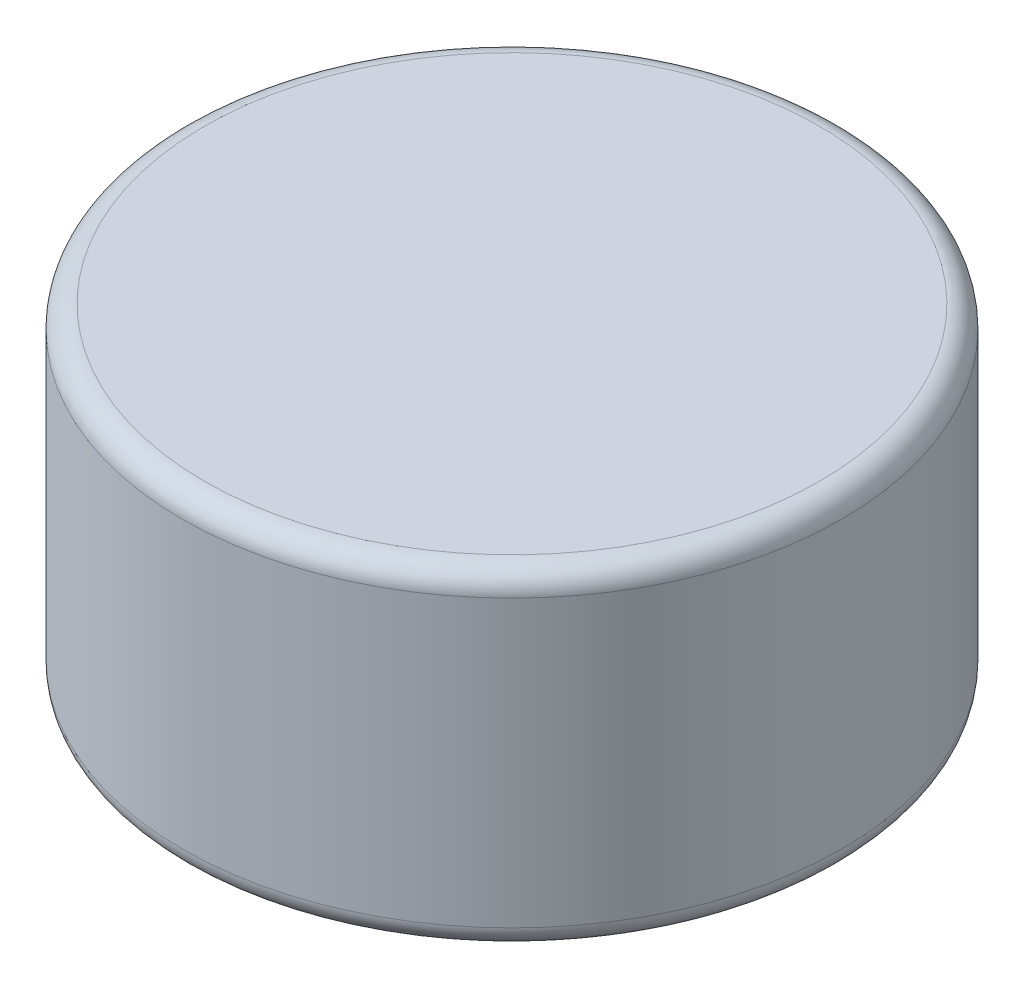
ISO-10303-21;
HEADER;
FILE_DESCRIPTION(('STEP AP214'),'2;1');
FILE_NAME('part.step','',(''),(''),'','','');
FILE_SCHEMA(('AUTOMOTIVE_DESIGN { 1 0 10303 214 1 1 1 1 }'));
ENDSEC;
DATA;
#1=APPLICATION_CONTEXT('core data for automotive mechanical design processes');
#2=APPLICATION_PROTOCOL_DEFINITION('international standard','automotive_design',2000,#1);
#3=PRODUCT_CONTEXT('',#1,'mechanical');
#4=PRODUCT('Part','Part','',(#3));
#5=PRODUCT_RELATED_PRODUCT_CATEGORY('part','',(#4));
#6=PRODUCT_DEFINITION_FORMATION('','',#4);
#7=PRODUCT_DEFINITION_CONTEXT('part definition',#1,'design');
#8=PRODUCT_DEFINITION('design','',#6,#7);
#9=PRODUCT_DEFINITION_SHAPE('','',#8);
#10=(LENGTH_UNIT() NAMED_UNIT(*) SI_UNIT(.MILLI.,.METRE.));
#11=(NAMED_UNIT(*) PLANE_ANGLE_UNIT() SI_UNIT($,.RADIAN.));
#12=(NAMED_UNIT(*) SI_UNIT($,.STERADIAN.) SOLID_ANGLE_UNIT());
#13=UNCERTAINTY_MEASURE_WITH_UNIT(LENGTH_MEASURE(1.E-05),#10,'distance_accuracy_value','');
#14=(GEOMETRIC_REPRESENTATION_CONTEXT(3) GLOBAL_UNCERTAINTY_ASSIGNED_CONTEXT((#13)) GLOBAL_UNIT_ASSIGNED_CONTEXT((#10,
#11,#12)) REPRESENTATION_CONTEXT('',''));
#15=CARTESIAN_POINT('',(0.,0.,0.));
#16=DIRECTION('',(0.,0.,1.));
#17=DIRECTION('',(1.,0.,0.));
#18=AXIS2_PLACEMENT_3D('',#15,#16,#17);
#19=CARTESIAN_POINT('',(0.,1.5,0.));
#20=DIRECTION('',(0.,-1.,0.));
#21=DIRECTION('',(0.,0.,-1.));
#22=AXIS2_PLACEMENT_3D('',#19,#20,#21);
#23=CYLINDRICAL_SURFACE('',#22,3.);
#24=CARTESIAN_POINT('',(0.,-1.3,0.));
#25=DIRECTION('',(0.,1.,0.));
#26=DIRECTION('',(0.,0.,1.));
#27=AXIS2_PLACEMENT_3D('',#24,#25,#26);
#28=CIRCLE('',#27,3.);
#29=CARTESIAN_POINT('',(0.,-1.3,3.));
#30=VERTEX_POINT('',#29);
#31=EDGE_CURVE('E42',#30,#30,#28,.T.);
#32=ORIENTED_EDGE('',*,*,#31,.T.);
#33=EDGE_LOOP('',(#32));
#34=FACE_BOUND('',#33,.T.);
#35=CARTESIAN_POINT('',(0.,1.3,0.));
#36=DIRECTION('',(0.,1.,0.));
#37=DIRECTION('',(0.,0.,1.));
#38=AXIS2_PLACEMENT_3D('',#35,#36,#37);
#39=CIRCLE('',#38,3.);
#40=CARTESIAN_POINT('',(0.,1.3,3.));
#41=VERTEX_POINT('',#40);
#42=EDGE_CURVE('E46',#41,#41,#39,.F.);
#43=ORIENTED_EDGE('',*,*,#42,.T.);
#44=EDGE_LOOP('',(#43));
#45=FACE_BOUND('',#44,.T.);
#46=ADVANCED_FACE('F31',(#34,#45),#23,.T.);
#47=CARTESIAN_POINT('',(0.,1.5,0.));
#48=DIRECTION('',(0.,1.,0.));
#49=DIRECTION('',(0.,0.,1.));
#50=AXIS2_PLACEMENT_3D('',#47,#48,#49);
#51=PLANE('',#50);
#52=CARTESIAN_POINT('',(0.,1.5,0.));
#53=DIRECTION('',(0.,1.,0.));
#54=DIRECTION('',(0.,0.,1.));
#55=AXIS2_PLACEMENT_3D('',#52,#53,#54);
#56=CIRCLE('',#55,2.8);
#57=CARTESIAN_POINT('',(0.,1.5,2.8));
#58=VERTEX_POINT('',#57);
#59=EDGE_CURVE('E10',#58,#58,#56,.T.);
#60=ORIENTED_EDGE('',*,*,#59,.T.);
#61=EDGE_LOOP('',(#60));
#62=FACE_BOUND('',#61,.T.);
#63=ADVANCED_FACE('F62',(#62),#51,.T.);
#64=CARTESIAN_POINT('',(0.,-1.5,0.));
#65=DIRECTION('',(0.,1.,0.));
#66=DIRECTION('',(0.,0.,1.));
#67=AXIS2_PLACEMENT_3D('',#64,#65,#66);
#68=PLANE('',#67);
#69=CARTESIAN_POINT('',(0.,-1.5,0.));
#70=DIRECTION('',(0.,1.,0.));
#71=DIRECTION('',(0.,0.,1.));
#72=AXIS2_PLACEMENT_3D('',#69,#70,#71);
#73=CIRCLE('',#72,2.8);
#74=CARTESIAN_POINT('',(0.,-1.5,2.8));
#75=VERTEX_POINT('',#74);
#76=EDGE_CURVE('E38',#75,#75,#73,.F.);
#77=ORIENTED_EDGE('',*,*,#76,.T.);
#78=EDGE_LOOP('',(#77));
#79=FACE_BOUND('',#78,.T.);
#80=ADVANCED_FACE('F59',(#79),#68,.F.);
#81=CARTESIAN_POINT('',(0.,-1.3,0.));
#82=DIRECTION('',(0.,1.,0.));
#83=DIRECTION('',(0.,0.,1.));
#84=AXIS2_PLACEMENT_3D('',#81,#82,#83);
#85=TOROIDAL_SURFACE('',#84,2.8,0.2);
#86=ORIENTED_EDGE('',*,*,#76,.F.);
#87=EDGE_LOOP('',(#86));
#88=FACE_BOUND('',#87,.T.);
#89=ORIENTED_EDGE('',*,*,#31,.F.);
#90=EDGE_LOOP('',(#89));
#91=FACE_BOUND('',#90,.T.);
#92=ADVANCED_FACE('F55',(#88,#91),#85,.T.);
#93=CARTESIAN_POINT('',(0.,1.3,0.));
#94=DIRECTION('',(0.,1.,0.));
#95=DIRECTION('',(0.,0.,1.));
#96=AXIS2_PLACEMENT_3D('',#93,#94,#95);
#97=TOROIDAL_SURFACE('',#96,2.8,0.2);
#98=ORIENTED_EDGE('',*,*,#42,.F.);
#99=EDGE_LOOP('',(#98));
#100=FACE_BOUND('',#99,.T.);
#101=ORIENTED_EDGE('',*,*,#59,.F.);
#102=EDGE_LOOP('',(#101));
#103=FACE_BOUND('',#102,.T.);
#104=ADVANCED_FACE('F33',(#100,#103),#97,.T.);
#105=CLOSED_SHELL('',(#46,#63,#80,#92,#104));
#106=MANIFOLD_SOLID_BREP('B2',#105);
#107=ADVANCED_BREP_SHAPE_REPRESENTATION('',(#18,#106),#14);
#108=SHAPE_DEFINITION_REPRESENTATION(#9,#107);
ENDSEC;
END-ISO-10303-21;
